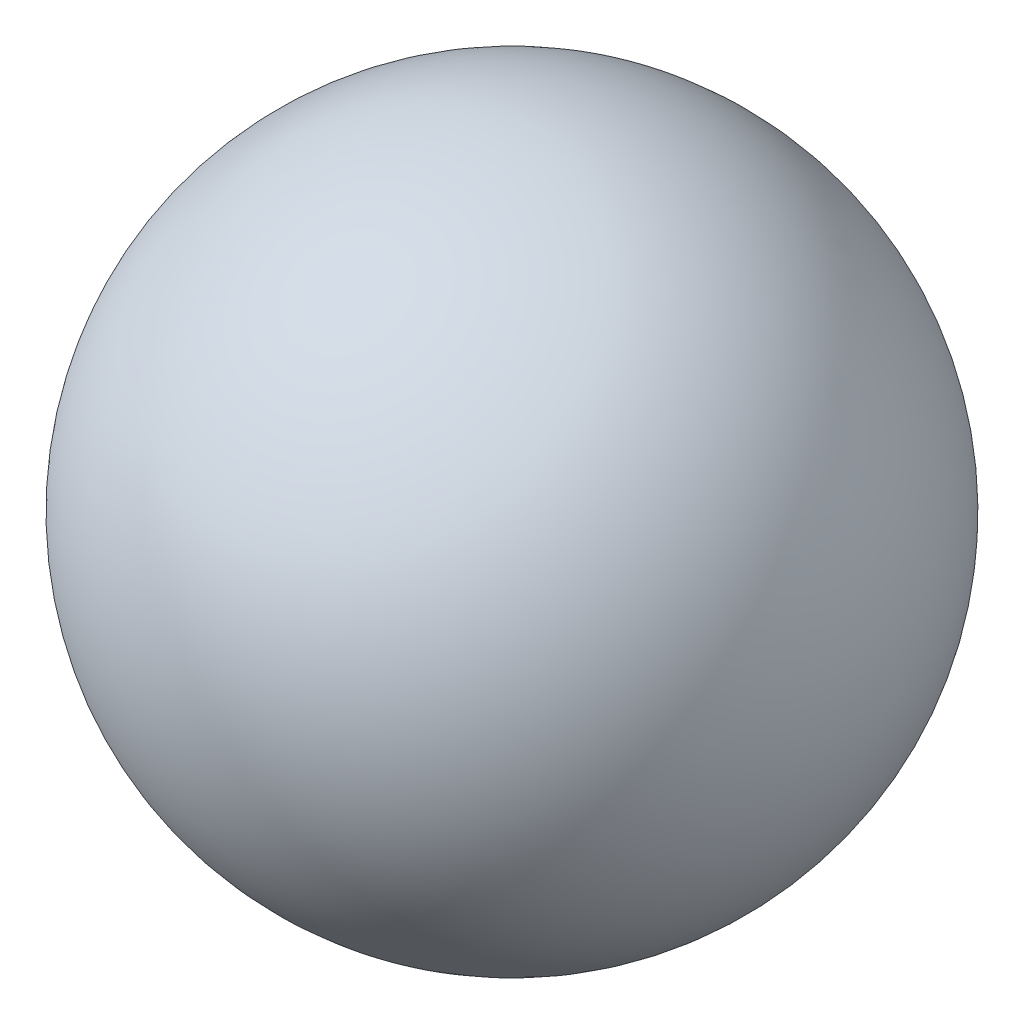
ISO-10303-21;
HEADER;
FILE_DESCRIPTION(('STEP AP214'),'2;1');
FILE_NAME('part.step','',(''),(''),'','','');
FILE_SCHEMA(('AUTOMOTIVE_DESIGN { 1 0 10303 214 1 1 1 1 }'));
ENDSEC;
DATA;
#1=APPLICATION_CONTEXT('core data for automotive mechanical design processes');
#2=APPLICATION_PROTOCOL_DEFINITION('international standard','automotive_design',2000,#1);
#3=PRODUCT_CONTEXT('',#1,'mechanical');
#4=PRODUCT('Part','Part','',(#3));
#5=PRODUCT_RELATED_PRODUCT_CATEGORY('part','',(#4));
#6=PRODUCT_DEFINITION_FORMATION('','',#4);
#7=PRODUCT_DEFINITION_CONTEXT('part definition',#1,'design');
#8=PRODUCT_DEFINITION('design','',#6,#7);
#9=PRODUCT_DEFINITION_SHAPE('','',#8);
#10=(LENGTH_UNIT() NAMED_UNIT(*) SI_UNIT(.MILLI.,.METRE.));
#11=(NAMED_UNIT(*) PLANE_ANGLE_UNIT() SI_UNIT($,.RADIAN.));
#12=(NAMED_UNIT(*) SI_UNIT($,.STERADIAN.) SOLID_ANGLE_UNIT());
#13=UNCERTAINTY_MEASURE_WITH_UNIT(LENGTH_MEASURE(1.E-05),#10,'distance_accuracy_value','');
#14=(GEOMETRIC_REPRESENTATION_CONTEXT(3) GLOBAL_UNCERTAINTY_ASSIGNED_CONTEXT((#13)) GLOBAL_UNIT_ASSIGNED_CONTEXT((#10,
#11,#12)) REPRESENTATION_CONTEXT('',''));
#15=CARTESIAN_POINT('',(0.,0.,0.));
#16=DIRECTION('',(0.,0.,1.));
#17=DIRECTION('',(1.,0.,0.));
#18=AXIS2_PLACEMENT_3D('',#15,#16,#17);
#19=CARTESIAN_POINT('',(64.16,-65.5771608423181,22.6635536679652));
#20=DIRECTION('',(0.,-0.945147382533446,0.326644187595885));
#21=DIRECTION('',(0.173648177666934,-0.321681728420802,-0.930788470058132));
#22=AXIS2_PLACEMENT_3D('',#19,#20,#21);
#23=SPHERICAL_SURFACE('',#22,7.15);
#24=CARTESIAN_POINT('',(64.16,-72.3349646274322,24.9990596092758));
#25=VERTEX_POINT('',#24);
#26=VERTEX_LOOP('',#25);
#27=FACE_BOUND('',#26,.T.);
#28=CARTESIAN_POINT('',(64.16,-58.819357057204,20.3280477266546));
#29=VERTEX_POINT('',#28);
#30=VERTEX_LOOP('',#29);
#31=FACE_BOUND('',#30,.T.);
#32=ADVANCED_FACE('F16',(#27,#31),#23,.T.);
#33=CLOSED_SHELL('',(#32));
#34=MANIFOLD_SOLID_BREP('B1',#33);
#35=ADVANCED_BREP_SHAPE_REPRESENTATION('',(#18,#34),#14);
#36=SHAPE_DEFINITION_REPRESENTATION(#9,#35);
ENDSEC;
END-ISO-10303-21;
